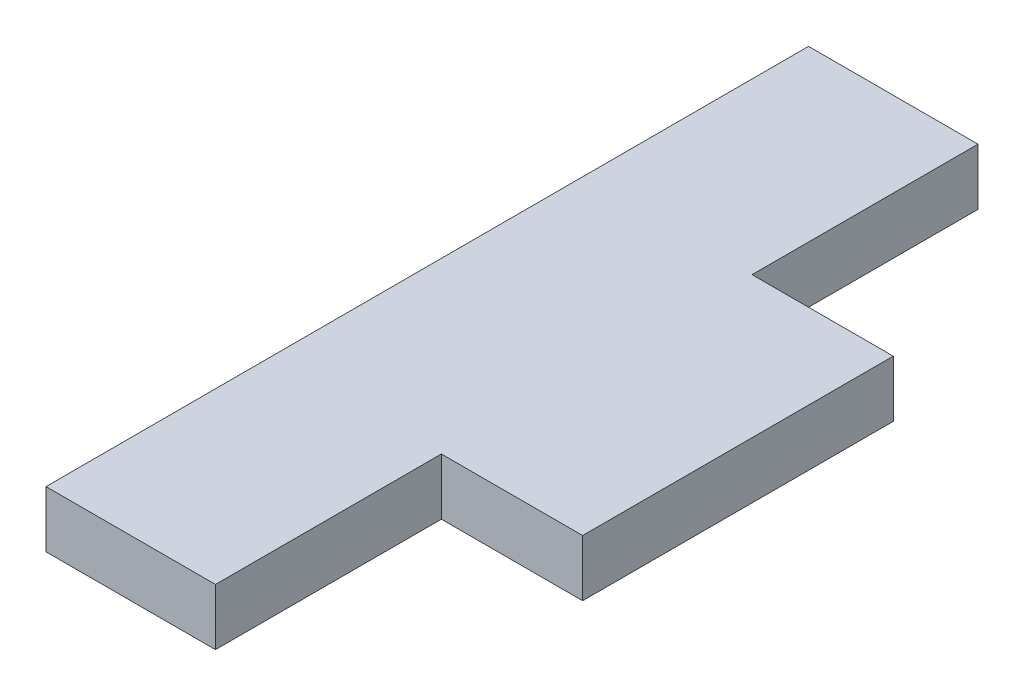
ISO-10303-21;
HEADER;
FILE_DESCRIPTION(('STEP AP214'),'2;1');
FILE_NAME('part.step','',(''),(''),'','','');
FILE_SCHEMA(('AUTOMOTIVE_DESIGN { 1 0 10303 214 1 1 1 1 }'));
ENDSEC;
DATA;
#1=APPLICATION_CONTEXT('core data for automotive mechanical design processes');
#2=APPLICATION_PROTOCOL_DEFINITION('international standard','automotive_design',2000,#1);
#3=PRODUCT_CONTEXT('',#1,'mechanical');
#4=PRODUCT('Part','Part','',(#3));
#5=PRODUCT_RELATED_PRODUCT_CATEGORY('part','',(#4));
#6=PRODUCT_DEFINITION_FORMATION('','',#4);
#7=PRODUCT_DEFINITION_CONTEXT('part definition',#1,'design');
#8=PRODUCT_DEFINITION('design','',#6,#7);
#9=PRODUCT_DEFINITION_SHAPE('','',#8);
#10=(LENGTH_UNIT() NAMED_UNIT(*) SI_UNIT(.MILLI.,.METRE.));
#11=(NAMED_UNIT(*) PLANE_ANGLE_UNIT() SI_UNIT($,.RADIAN.));
#12=(NAMED_UNIT(*) SI_UNIT($,.STERADIAN.) SOLID_ANGLE_UNIT());
#13=UNCERTAINTY_MEASURE_WITH_UNIT(LENGTH_MEASURE(1.E-05),#10,'distance_accuracy_value','');
#14=(GEOMETRIC_REPRESENTATION_CONTEXT(3) GLOBAL_UNCERTAINTY_ASSIGNED_CONTEXT((#13)) GLOBAL_UNIT_ASSIGNED_CONTEXT((#10,
#11,#12)) REPRESENTATION_CONTEXT('',''));
#15=CARTESIAN_POINT('',(0.,0.,0.));
#16=DIRECTION('',(0.,0.,1.));
#17=DIRECTION('',(1.,0.,0.));
#18=AXIS2_PLACEMENT_3D('',#15,#16,#17);
#19=CARTESIAN_POINT('',(-25.4528650646949,10.,70.9935304990758));
#20=DIRECTION('',(1.,0.,0.));
#21=DIRECTION('',(0.,0.,-1.));
#22=AXIS2_PLACEMENT_3D('',#19,#20,#21);
#23=PLANE('',#22);
#24=DIRECTION('',(0.,0.,1.));
#25=VECTOR('',#24,1.);
#26=CARTESIAN_POINT('',(-25.4528650646949,0.,70.9935304990758));
#27=LINE('',#26,#25);
#28=CARTESIAN_POINT('',(-25.4528650646949,0.,-64.0064695009242));
#29=VERTEX_POINT('',#28);
#30=CARTESIAN_POINT('',(-25.4528650646949,0.,70.9935304990758));
#31=VERTEX_POINT('',#30);
#32=EDGE_CURVE('E137',#29,#31,#27,.T.);
#33=ORIENTED_EDGE('',*,*,#32,.T.);
#34=DIRECTION('',(0.,-1.,0.));
#35=VECTOR('',#34,1.);
#36=CARTESIAN_POINT('',(-25.4528650646949,10.,70.9935304990758));
#37=LINE('',#36,#35);
#38=CARTESIAN_POINT('',(-25.4528650646949,10.,70.9935304990758));
#39=VERTEX_POINT('',#38);
#40=EDGE_CURVE('E11',#39,#31,#37,.T.);
#41=ORIENTED_EDGE('',*,*,#40,.F.);
#42=DIRECTION('',(0.,0.,1.));
#43=VECTOR('',#42,1.);
#44=CARTESIAN_POINT('',(-25.4528650646949,10.,70.9935304990758));
#45=LINE('',#44,#43);
#46=CARTESIAN_POINT('',(-25.4528650646949,10.,-64.0064695009242));
#47=VERTEX_POINT('',#46);
#48=EDGE_CURVE('E151',#47,#39,#45,.T.);
#49=ORIENTED_EDGE('',*,*,#48,.F.);
#50=DIRECTION('',(0.,-1.,0.));
#51=VECTOR('',#50,1.);
#52=CARTESIAN_POINT('',(-25.4528650646949,10.,-64.0064695009242));
#53=LINE('',#52,#51);
#54=EDGE_CURVE('E133',#47,#29,#53,.T.);
#55=ORIENTED_EDGE('',*,*,#54,.T.);
#56=EDGE_LOOP('',(#33,#41,#49,#55));
#57=FACE_BOUND('',#56,.T.);
#58=ADVANCED_FACE('F41',(#57),#23,.F.);
#59=CARTESIAN_POINT('',(4.54713493530505,10.,70.9935304990758));
#60=DIRECTION('',(0.,0.,-1.));
#61=DIRECTION('',(-1.,0.,0.));
#62=AXIS2_PLACEMENT_3D('',#59,#60,#61);
#63=PLANE('',#62);
#64=DIRECTION('',(1.,0.,0.));
#65=VECTOR('',#64,1.);
#66=CARTESIAN_POINT('',(4.54713493530505,0.,70.9935304990758));
#67=LINE('',#66,#65);
#68=CARTESIAN_POINT('',(4.54713493530505,0.,70.9935304990758));
#69=VERTEX_POINT('',#68);
#70=EDGE_CURVE('E140',#31,#69,#67,.T.);
#71=ORIENTED_EDGE('',*,*,#70,.T.);
#72=DIRECTION('',(0.,-1.,0.));
#73=VECTOR('',#72,1.);
#74=CARTESIAN_POINT('',(4.54713493530505,10.,70.9935304990758));
#75=LINE('',#74,#73);
#76=CARTESIAN_POINT('',(4.54713493530505,10.,70.9935304990758));
#77=VERTEX_POINT('',#76);
#78=EDGE_CURVE('E49',#77,#69,#75,.T.);
#79=ORIENTED_EDGE('',*,*,#78,.F.);
#80=DIRECTION('',(1.,0.,0.));
#81=VECTOR('',#80,1.);
#82=CARTESIAN_POINT('',(4.54713493530505,10.,70.9935304990758));
#83=LINE('',#82,#81);
#84=EDGE_CURVE('E100',#39,#77,#83,.T.);
#85=ORIENTED_EDGE('',*,*,#84,.F.);
#86=ORIENTED_EDGE('',*,*,#40,.T.);
#87=EDGE_LOOP('',(#71,#79,#85,#86));
#88=FACE_BOUND('',#87,.T.);
#89=ADVANCED_FACE('F186',(#88),#63,.F.);
#90=CARTESIAN_POINT('',(4.54713493530505,10.,30.9935304990758));
#91=DIRECTION('',(-1.,0.,0.));
#92=DIRECTION('',(0.,0.,1.));
#93=AXIS2_PLACEMENT_3D('',#90,#91,#92);
#94=PLANE('',#93);
#95=DIRECTION('',(0.,0.,-1.));
#96=VECTOR('',#95,1.);
#97=CARTESIAN_POINT('',(4.54713493530505,0.,30.9935304990758));
#98=LINE('',#97,#96);
#99=CARTESIAN_POINT('',(4.54713493530505,0.,30.9935304990758));
#100=VERTEX_POINT('',#99);
#101=EDGE_CURVE('E142',#69,#100,#98,.T.);
#102=ORIENTED_EDGE('',*,*,#101,.T.);
#103=DIRECTION('',(0.,-1.,0.));
#104=VECTOR('',#103,1.);
#105=CARTESIAN_POINT('',(4.54713493530505,10.,30.9935304990758));
#106=LINE('',#105,#104);
#107=CARTESIAN_POINT('',(4.54713493530505,10.,30.9935304990758));
#108=VERTEX_POINT('',#107);
#109=EDGE_CURVE('E158',#108,#100,#106,.T.);
#110=ORIENTED_EDGE('',*,*,#109,.F.);
#111=DIRECTION('',(0.,0.,-1.));
#112=VECTOR('',#111,1.);
#113=CARTESIAN_POINT('',(4.54713493530505,10.,30.9935304990758));
#114=LINE('',#113,#112);
#115=EDGE_CURVE('E166',#77,#108,#114,.T.);
#116=ORIENTED_EDGE('',*,*,#115,.F.);
#117=ORIENTED_EDGE('',*,*,#78,.T.);
#118=EDGE_LOOP('',(#102,#110,#116,#117));
#119=FACE_BOUND('',#118,.T.);
#120=ADVANCED_FACE('F164',(#119),#94,.F.);
#121=CARTESIAN_POINT('',(4.54713493530505,10.,30.9935304990758));
#122=DIRECTION('',(0.,0.,-1.));
#123=DIRECTION('',(-1.,0.,0.));
#124=AXIS2_PLACEMENT_3D('',#121,#122,#123);
#125=PLANE('',#124);
#126=DIRECTION('',(1.,0.,0.));
#127=VECTOR('',#126,1.);
#128=CARTESIAN_POINT('',(4.54713493530505,0.,30.9935304990758));
#129=LINE('',#128,#127);
#130=CARTESIAN_POINT('',(29.5471349353051,0.,30.9935304990758));
#131=VERTEX_POINT('',#130);
#132=EDGE_CURVE('E144',#100,#131,#129,.T.);
#133=ORIENTED_EDGE('',*,*,#132,.T.);
#134=DIRECTION('',(0.,-1.,0.));
#135=VECTOR('',#134,1.);
#136=CARTESIAN_POINT('',(29.5471349353051,10.,30.9935304990758));
#137=LINE('',#136,#135);
#138=CARTESIAN_POINT('',(29.5471349353051,10.,30.9935304990758));
#139=VERTEX_POINT('',#138);
#140=EDGE_CURVE('E155',#139,#131,#137,.T.);
#141=ORIENTED_EDGE('',*,*,#140,.F.);
#142=DIRECTION('',(1.,0.,0.));
#143=VECTOR('',#142,1.);
#144=CARTESIAN_POINT('',(4.54713493530505,10.,30.9935304990758));
#145=LINE('',#144,#143);
#146=EDGE_CURVE('E178',#108,#139,#145,.T.);
#147=ORIENTED_EDGE('',*,*,#146,.F.);
#148=ORIENTED_EDGE('',*,*,#109,.T.);
#149=EDGE_LOOP('',(#133,#141,#147,#148));
#150=FACE_BOUND('',#149,.T.);
#151=ADVANCED_FACE('F174',(#150),#125,.F.);
#152=CARTESIAN_POINT('',(29.5471349353051,10.,-24.0064695009242));
#153=DIRECTION('',(-1.,0.,0.));
#154=DIRECTION('',(0.,0.,1.));
#155=AXIS2_PLACEMENT_3D('',#152,#153,#154);
#156=PLANE('',#155);
#157=DIRECTION('',(0.,0.,-1.));
#158=VECTOR('',#157,1.);
#159=CARTESIAN_POINT('',(29.5471349353051,0.,-24.0064695009242));
#160=LINE('',#159,#158);
#161=CARTESIAN_POINT('',(29.5471349353051,0.,-24.0064695009242));
#162=VERTEX_POINT('',#161);
#163=EDGE_CURVE('E146',#131,#162,#160,.T.);
#164=ORIENTED_EDGE('',*,*,#163,.T.);
#165=DIRECTION('',(0.,-1.,0.));
#166=VECTOR('',#165,1.);
#167=CARTESIAN_POINT('',(29.5471349353051,10.,-24.0064695009242));
#168=LINE('',#167,#166);
#169=CARTESIAN_POINT('',(29.5471349353051,10.,-24.0064695009242));
#170=VERTEX_POINT('',#169);
#171=EDGE_CURVE('E128',#170,#162,#168,.T.);
#172=ORIENTED_EDGE('',*,*,#171,.F.);
#173=DIRECTION('',(0.,0.,-1.));
#174=VECTOR('',#173,1.);
#175=CARTESIAN_POINT('',(29.5471349353051,10.,-24.0064695009242));
#176=LINE('',#175,#174);
#177=EDGE_CURVE('E119',#139,#170,#176,.T.);
#178=ORIENTED_EDGE('',*,*,#177,.F.);
#179=ORIENTED_EDGE('',*,*,#140,.T.);
#180=EDGE_LOOP('',(#164,#172,#178,#179));
#181=FACE_BOUND('',#180,.T.);
#182=ADVANCED_FACE('F177',(#181),#156,.F.);
#183=CARTESIAN_POINT('',(4.54713493530506,10.,-24.0064695009242));
#184=DIRECTION('',(0.,0.,1.));
#185=DIRECTION('',(1.,0.,0.));
#186=AXIS2_PLACEMENT_3D('',#183,#184,#185);
#187=PLANE('',#186);
#188=DIRECTION('',(-1.,0.,0.));
#189=VECTOR('',#188,1.);
#190=CARTESIAN_POINT('',(4.54713493530506,0.,-24.0064695009242));
#191=LINE('',#190,#189);
#192=CARTESIAN_POINT('',(4.54713493530506,0.,-24.0064695009242));
#193=VERTEX_POINT('',#192);
#194=EDGE_CURVE('E127',#162,#193,#191,.T.);
#195=ORIENTED_EDGE('',*,*,#194,.T.);
#196=DIRECTION('',(0.,-1.,0.));
#197=VECTOR('',#196,1.);
#198=CARTESIAN_POINT('',(4.54713493530506,10.,-24.0064695009242));
#199=LINE('',#198,#197);
#200=CARTESIAN_POINT('',(4.54713493530506,10.,-24.0064695009242));
#201=VERTEX_POINT('',#200);
#202=EDGE_CURVE('E124',#201,#193,#199,.T.);
#203=ORIENTED_EDGE('',*,*,#202,.F.);
#204=DIRECTION('',(-1.,0.,0.));
#205=VECTOR('',#204,1.);
#206=CARTESIAN_POINT('',(4.54713493530506,10.,-24.0064695009242));
#207=LINE('',#206,#205);
#208=EDGE_CURVE('E113',#170,#201,#207,.T.);
#209=ORIENTED_EDGE('',*,*,#208,.F.);
#210=ORIENTED_EDGE('',*,*,#171,.T.);
#211=EDGE_LOOP('',(#195,#203,#209,#210));
#212=FACE_BOUND('',#211,.T.);
#213=ADVANCED_FACE('F125',(#212),#187,.F.);
#214=CARTESIAN_POINT('',(4.54713493530505,10.,-64.0064695009242));
#215=DIRECTION('',(-1.,0.,0.));
#216=DIRECTION('',(0.,0.,1.));
#217=AXIS2_PLACEMENT_3D('',#214,#215,#216);
#218=PLANE('',#217);
#219=DIRECTION('',(0.,0.,-1.));
#220=VECTOR('',#219,1.);
#221=CARTESIAN_POINT('',(4.54713493530505,0.,-64.0064695009242));
#222=LINE('',#221,#220);
#223=CARTESIAN_POINT('',(4.54713493530505,0.,-64.0064695009242));
#224=VERTEX_POINT('',#223);
#225=EDGE_CURVE('E86',#193,#224,#222,.T.);
#226=ORIENTED_EDGE('',*,*,#225,.T.);
#227=DIRECTION('',(0.,-1.,0.));
#228=VECTOR('',#227,1.);
#229=CARTESIAN_POINT('',(4.54713493530505,10.,-64.0064695009242));
#230=LINE('',#229,#228);
#231=CARTESIAN_POINT('',(4.54713493530505,10.,-64.0064695009242));
#232=VERTEX_POINT('',#231);
#233=EDGE_CURVE('E129',#232,#224,#230,.T.);
#234=ORIENTED_EDGE('',*,*,#233,.F.);
#235=DIRECTION('',(0.,0.,-1.));
#236=VECTOR('',#235,1.);
#237=CARTESIAN_POINT('',(4.54713493530505,10.,-64.0064695009242));
#238=LINE('',#237,#236);
#239=EDGE_CURVE('E117',#201,#232,#238,.T.);
#240=ORIENTED_EDGE('',*,*,#239,.F.);
#241=ORIENTED_EDGE('',*,*,#202,.T.);
#242=EDGE_LOOP('',(#226,#234,#240,#241));
#243=FACE_BOUND('',#242,.T.);
#244=ADVANCED_FACE('F131',(#243),#218,.F.);
#245=CARTESIAN_POINT('',(4.54713493530505,10.,-64.0064695009242));
#246=DIRECTION('',(0.,0.,1.));
#247=DIRECTION('',(1.,0.,0.));
#248=AXIS2_PLACEMENT_3D('',#245,#246,#247);
#249=PLANE('',#248);
#250=DIRECTION('',(-1.,0.,0.));
#251=VECTOR('',#250,1.);
#252=CARTESIAN_POINT('',(4.54713493530505,0.,-64.0064695009242));
#253=LINE('',#252,#251);
#254=EDGE_CURVE('E92',#224,#29,#253,.T.);
#255=ORIENTED_EDGE('',*,*,#254,.T.);
#256=ORIENTED_EDGE('',*,*,#54,.F.);
#257=DIRECTION('',(-1.,0.,0.));
#258=VECTOR('',#257,1.);
#259=CARTESIAN_POINT('',(4.54713493530505,10.,-64.0064695009242));
#260=LINE('',#259,#258);
#261=EDGE_CURVE('E57',#232,#47,#260,.T.);
#262=ORIENTED_EDGE('',*,*,#261,.F.);
#263=ORIENTED_EDGE('',*,*,#233,.T.);
#264=EDGE_LOOP('',(#255,#256,#262,#263));
#265=FACE_BOUND('',#264,.T.);
#266=ADVANCED_FACE('F201',(#265),#249,.F.);
#267=CARTESIAN_POINT('',(0.,10.,0.));
#268=DIRECTION('',(0.,1.,0.));
#269=DIRECTION('',(0.,0.,1.));
#270=AXIS2_PLACEMENT_3D('',#267,#268,#269);
#271=PLANE('',#270);
#272=ORIENTED_EDGE('',*,*,#48,.T.);
#273=ORIENTED_EDGE('',*,*,#84,.T.);
#274=ORIENTED_EDGE('',*,*,#115,.T.);
#275=ORIENTED_EDGE('',*,*,#146,.T.);
#276=ORIENTED_EDGE('',*,*,#177,.T.);
#277=ORIENTED_EDGE('',*,*,#208,.T.);
#278=ORIENTED_EDGE('',*,*,#239,.T.);
#279=ORIENTED_EDGE('',*,*,#261,.T.);
#280=EDGE_LOOP('',(#272,#273,#274,#275,#276,#277,#278,#279));
#281=FACE_BOUND('',#280,.T.);
#282=ADVANCED_FACE('F115',(#281),#271,.T.);
#283=CARTESIAN_POINT('',(0.,0.,0.));
#284=DIRECTION('',(0.,1.,0.));
#285=DIRECTION('',(0.,0.,1.));
#286=AXIS2_PLACEMENT_3D('',#283,#284,#285);
#287=PLANE('',#286);
#288=ORIENTED_EDGE('',*,*,#32,.F.);
#289=ORIENTED_EDGE('',*,*,#254,.F.);
#290=ORIENTED_EDGE('',*,*,#225,.F.);
#291=ORIENTED_EDGE('',*,*,#194,.F.);
#292=ORIENTED_EDGE('',*,*,#163,.F.);
#293=ORIENTED_EDGE('',*,*,#132,.F.);
#294=ORIENTED_EDGE('',*,*,#101,.F.);
#295=ORIENTED_EDGE('',*,*,#70,.F.);
#296=EDGE_LOOP('',(#288,#289,#290,#291,#292,#293,#294,#295));
#297=FACE_BOUND('',#296,.T.);
#298=ADVANCED_FACE('F170',(#297),#287,.F.);
#299=CLOSED_SHELL('',(#58,#89,#120,#151,#182,#213,#244,#266,#282,#298));
#300=MANIFOLD_SOLID_BREP('B2',#299);
#301=ADVANCED_BREP_SHAPE_REPRESENTATION('',(#18,#300),#14);
#302=SHAPE_DEFINITION_REPRESENTATION(#9,#301);
ENDSEC;
END-ISO-10303-21;
